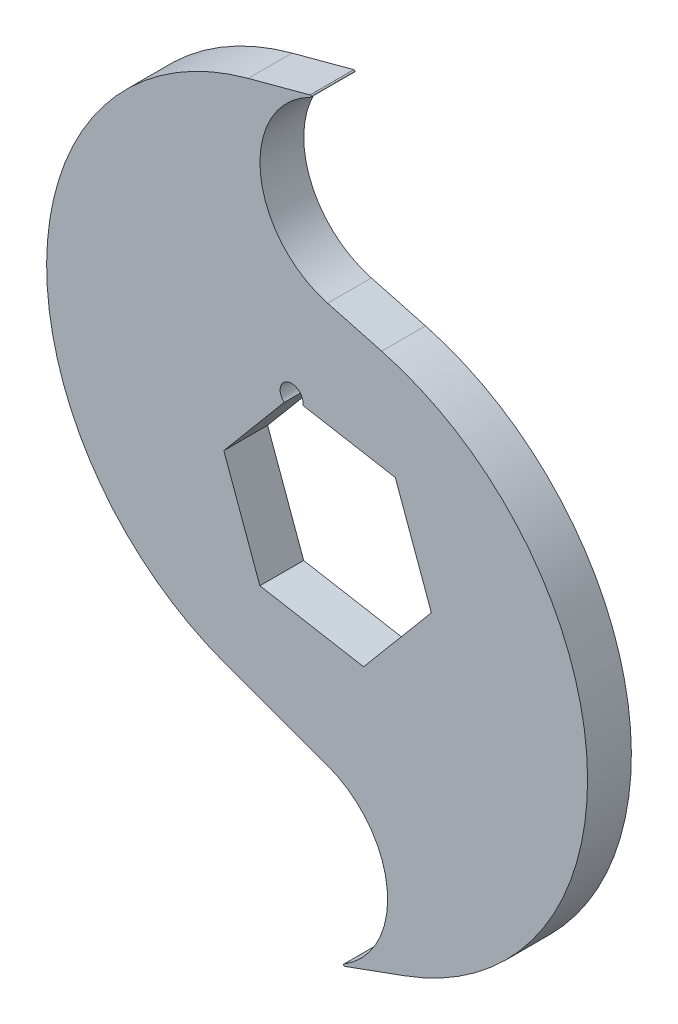
ISO-10303-21;
HEADER;
FILE_DESCRIPTION(('STEP AP214'),'2;1');
FILE_NAME('part.step','',(''),(''),'','','');
FILE_SCHEMA(('AUTOMOTIVE_DESIGN { 1 0 10303 214 1 1 1 1 }'));
ENDSEC;
DATA;
#1=APPLICATION_CONTEXT('core data for automotive mechanical design processes');
#2=APPLICATION_PROTOCOL_DEFINITION('international standard','automotive_design',2000,#1);
#3=PRODUCT_CONTEXT('',#1,'mechanical');
#4=PRODUCT('Part','Part','',(#3));
#5=PRODUCT_RELATED_PRODUCT_CATEGORY('part','',(#4));
#6=PRODUCT_DEFINITION_FORMATION('','',#4);
#7=PRODUCT_DEFINITION_CONTEXT('part definition',#1,'design');
#8=PRODUCT_DEFINITION('design','',#6,#7);
#9=PRODUCT_DEFINITION_SHAPE('','',#8);
#10=(LENGTH_UNIT() NAMED_UNIT(*) SI_UNIT(.MILLI.,.METRE.));
#11=(NAMED_UNIT(*) PLANE_ANGLE_UNIT() SI_UNIT($,.RADIAN.));
#12=(NAMED_UNIT(*) SI_UNIT($,.STERADIAN.) SOLID_ANGLE_UNIT());
#13=UNCERTAINTY_MEASURE_WITH_UNIT(LENGTH_MEASURE(1.E-05),#10,'distance_accuracy_value','');
#14=(GEOMETRIC_REPRESENTATION_CONTEXT(3) GLOBAL_UNCERTAINTY_ASSIGNED_CONTEXT((#13)) GLOBAL_UNIT_ASSIGNED_CONTEXT((#10,
#11,#12)) REPRESENTATION_CONTEXT('',''));
#15=CARTESIAN_POINT('',(0.,0.,0.));
#16=DIRECTION('',(0.,0.,1.));
#17=DIRECTION('',(1.,0.,0.));
#18=AXIS2_PLACEMENT_3D('',#15,#16,#17);
#19=CARTESIAN_POINT('',(-13.0174999999999,48.5819713875279,3.048));
#20=DIRECTION('',(0.258819045102518,-0.965925826289069,0.));
#21=DIRECTION('',(0.965925826289069,0.258819045102518,0.));
#22=AXIS2_PLACEMENT_3D('',#19,#20,#21);
#23=PLANE('',#22);
#24=DIRECTION('',(-0.965925826289069,-0.258819045102518,0.));
#25=VECTOR('',#24,1.);
#26=CARTESIAN_POINT('',(-13.0174999999999,48.5819713875279,3.048));
#27=LINE('',#26,#25);
#28=CARTESIAN_POINT('',(-2.45345159877423,51.4125996254396,3.048));
#29=VERTEX_POINT('',#28);
#30=CARTESIAN_POINT('',(-11.0405321944841,49.1116983144782,3.048));
#31=VERTEX_POINT('',#30);
#32=EDGE_CURVE('E192',#29,#31,#27,.T.);
#33=ORIENTED_EDGE('',*,*,#32,.F.);
#34=DIRECTION('',(0.,0.,1.));
#35=VECTOR('',#34,1.);
#36=CARTESIAN_POINT('',(-2.45345159877423,51.4125996254396,-3.048));
#37=LINE('',#36,#35);
#38=CARTESIAN_POINT('',(-2.45345159877423,51.4125996254396,-3.048));
#39=VERTEX_POINT('',#38);
#40=EDGE_CURVE('E42',#29,#39,#37,.F.);
#41=ORIENTED_EDGE('',*,*,#40,.T.);
#42=DIRECTION('',(-0.965925826289069,-0.258819045102518,0.));
#43=VECTOR('',#42,1.);
#44=CARTESIAN_POINT('',(-13.0174999999999,48.5819713875279,-3.048));
#45=LINE('',#44,#43);
#46=CARTESIAN_POINT('',(-11.0405321944841,49.1116983144782,-3.048));
#47=VERTEX_POINT('',#46);
#48=EDGE_CURVE('E229',#39,#47,#45,.T.);
#49=ORIENTED_EDGE('',*,*,#48,.T.);
#50=DIRECTION('',(0.,0.,-1.));
#51=VECTOR('',#50,1.);
#52=CARTESIAN_POINT('',(-11.0405321944841,49.1116983144782,3.048));
#53=LINE('',#52,#51);
#54=EDGE_CURVE('E260',#31,#47,#53,.T.);
#55=ORIENTED_EDGE('',*,*,#54,.F.);
#56=EDGE_LOOP('',(#33,#41,#49,#55));
#57=FACE_BOUND('',#56,.T.);
#58=ADVANCED_FACE('F34',(#57),#23,.F.);
#59=CARTESIAN_POINT('',(-1.24139416120389,12.5408173038956,3.048));
#60=DIRECTION('',(0.,0.,-1.));
#61=DIRECTION('',(-1.,0.,0.));
#62=AXIS2_PLACEMENT_3D('',#59,#60,#61);
#63=CYLINDRICAL_SURFACE('',#62,37.8609620068675);
#64=CARTESIAN_POINT('',(-1.24139416120389,12.5408173038956,-3.048));
#65=DIRECTION('',(0.,0.,1.));
#66=DIRECTION('',(1.,0.,0.));
#67=AXIS2_PLACEMENT_3D('',#64,#65,#66);
#68=CIRCLE('',#67,37.8609620068675);
#69=CARTESIAN_POINT('',(-14.1906058132406,-23.0368493098134,-3.048));
#70=VERTEX_POINT('',#69);
#71=EDGE_CURVE('E231',#47,#70,#68,.T.);
#72=ORIENTED_EDGE('',*,*,#71,.T.);
#73=DIRECTION('',(0.,0.,-1.));
#74=VECTOR('',#73,1.);
#75=CARTESIAN_POINT('',(-14.1906058132406,-23.0368493098134,3.048));
#76=LINE('',#75,#74);
#77=CARTESIAN_POINT('',(-14.1906058132406,-23.0368493098134,3.048));
#78=VERTEX_POINT('',#77);
#79=EDGE_CURVE('E258',#78,#70,#76,.T.);
#80=ORIENTED_EDGE('',*,*,#79,.F.);
#81=CARTESIAN_POINT('',(-1.24139416120389,12.5408173038956,3.048));
#82=DIRECTION('',(0.,0.,1.));
#83=DIRECTION('',(1.,0.,0.));
#84=AXIS2_PLACEMENT_3D('',#81,#82,#83);
#85=CIRCLE('',#84,37.8609620068675);
#86=EDGE_CURVE('E194',#31,#78,#85,.T.);
#87=ORIENTED_EDGE('',*,*,#86,.F.);
#88=ORIENTED_EDGE('',*,*,#54,.T.);
#89=EDGE_LOOP('',(#72,#80,#87,#88));
#90=FACE_BOUND('',#89,.T.);
#91=ADVANCED_FACE('F298',(#90),#63,.T.);
#92=CARTESIAN_POINT('',(-9.06388619403997,-24.902822650631,3.048));
#93=DIRECTION('',(-0.342020143325673,-0.939692620785907,0.));
#94=DIRECTION('',(0.939692620785907,-0.342020143325673,0.));
#95=AXIS2_PLACEMENT_3D('',#92,#93,#94);
#96=PLANE('',#95);
#97=DIRECTION('',(-0.939692620785907,0.342020143325673,0.));
#98=VECTOR('',#97,1.);
#99=CARTESIAN_POINT('',(-9.06388619403997,-24.902822650631,-3.048));
#100=LINE('',#99,#98);
#101=CARTESIAN_POINT('',(0.,-28.2018074320379,-3.048));
#102=VERTEX_POINT('',#101);
#103=EDGE_CURVE('E234',#102,#70,#100,.T.);
#104=ORIENTED_EDGE('',*,*,#103,.F.);
#105=DIRECTION('',(0.,0.,-1.));
#106=VECTOR('',#105,1.);
#107=CARTESIAN_POINT('',(0.,-28.2018074320379,3.048));
#108=LINE('',#107,#106);
#109=CARTESIAN_POINT('',(0.,-28.2018074320379,3.048));
#110=VERTEX_POINT('',#109);
#111=EDGE_CURVE('E255',#110,#102,#108,.T.);
#112=ORIENTED_EDGE('',*,*,#111,.F.);
#113=DIRECTION('',(-0.939692620785907,0.342020143325673,0.));
#114=VECTOR('',#113,1.);
#115=CARTESIAN_POINT('',(-9.06388619403997,-24.902822650631,3.048));
#116=LINE('',#115,#114);
#117=EDGE_CURVE('E196',#110,#78,#116,.T.);
#118=ORIENTED_EDGE('',*,*,#117,.T.);
#119=ORIENTED_EDGE('',*,*,#79,.T.);
#120=EDGE_LOOP('',(#104,#112,#118,#119));
#121=FACE_BOUND('',#120,.T.);
#122=ADVANCED_FACE('F304',(#121),#96,.T.);
#123=CARTESIAN_POINT('',(-4.34365582023604,-40.135903716019,3.048));
#124=DIRECTION('',(0.,0.,-1.));
#125=DIRECTION('',(-1.,0.,0.));
#126=AXIS2_PLACEMENT_3D('',#123,#124,#125);
#127=CYLINDRICAL_SURFACE('',#126,12.7);
#128=CARTESIAN_POINT('',(-4.34365582023604,-40.135903716019,-3.048));
#129=DIRECTION('',(0.,0.,1.));
#130=DIRECTION('',(1.,0.,0.));
#131=AXIS2_PLACEMENT_3D('',#128,#129,#130);
#132=CIRCLE('',#131,12.7);
#133=CARTESIAN_POINT('',(2.27717439642722,-50.9735513963101,-3.048));
#134=VERTEX_POINT('',#133);
#135=EDGE_CURVE('E237',#134,#102,#132,.T.);
#136=ORIENTED_EDGE('',*,*,#135,.F.);
#137=DIRECTION('',(0.,0.,-1.));
#138=VECTOR('',#137,1.);
#139=CARTESIAN_POINT('',(2.27717439642722,-50.9735513963101,3.048));
#140=LINE('',#139,#138);
#141=CARTESIAN_POINT('',(2.27717439642722,-50.9735513963101,3.048));
#142=VERTEX_POINT('',#141);
#143=EDGE_CURVE('E280',#134,#142,#140,.F.);
#144=ORIENTED_EDGE('',*,*,#143,.T.);
#145=CARTESIAN_POINT('',(-4.34365582023604,-40.135903716019,3.048));
#146=DIRECTION('',(0.,0.,1.));
#147=DIRECTION('',(1.,0.,0.));
#148=AXIS2_PLACEMENT_3D('',#145,#146,#147);
#149=CIRCLE('',#148,12.7);
#150=EDGE_CURVE('E199',#142,#110,#149,.T.);
#151=ORIENTED_EDGE('',*,*,#150,.T.);
#152=ORIENTED_EDGE('',*,*,#111,.T.);
#153=EDGE_LOOP('',(#136,#144,#151,#152));
#154=FACE_BOUND('',#153,.T.);
#155=ADVANCED_FACE('F307',(#154),#127,.F.);
#156=CARTESIAN_POINT('',(16.7349754181892,-45.9789670766024,3.048));
#157=DIRECTION('',(-0.342020143325673,0.939692620785907,0.));
#158=DIRECTION('',(-0.939692620785907,-0.342020143325673,0.));
#159=AXIS2_PLACEMENT_3D('',#156,#157,#158);
#160=PLANE('',#159);
#161=DIRECTION('',(0.939692620785907,0.342020143325673,0.));
#162=VECTOR('',#161,1.);
#163=CARTESIAN_POINT('',(16.7349754181892,-45.9789670766024,3.048));
#164=LINE('',#163,#162);
#165=CARTESIAN_POINT('',(2.38681925679621,-51.2012688359528,3.048));
#166=VERTEX_POINT('',#165);
#167=CARTESIAN_POINT('',(10.7406866555829,-48.1607097617875,3.048));
#168=VERTEX_POINT('',#167);
#169=EDGE_CURVE('E201',#166,#168,#164,.T.);
#170=ORIENTED_EDGE('',*,*,#169,.F.);
#171=DIRECTION('',(0.,0.,1.));
#172=VECTOR('',#171,1.);
#173=CARTESIAN_POINT('',(2.38681925679621,-51.2012688359528,-3.048));
#174=LINE('',#173,#172);
#175=CARTESIAN_POINT('',(2.38681925679621,-51.2012688359528,-3.048));
#176=VERTEX_POINT('',#175);
#177=EDGE_CURVE('E263',#166,#176,#174,.F.);
#178=ORIENTED_EDGE('',*,*,#177,.T.);
#179=DIRECTION('',(0.939692620785907,0.342020143325673,0.));
#180=VECTOR('',#179,1.);
#181=CARTESIAN_POINT('',(16.7349754181892,-45.9789670766024,-3.048));
#182=LINE('',#181,#180);
#183=CARTESIAN_POINT('',(10.7406866555829,-48.1607097617875,-3.048));
#184=VERTEX_POINT('',#183);
#185=EDGE_CURVE('E239',#176,#184,#182,.T.);
#186=ORIENTED_EDGE('',*,*,#185,.T.);
#187=DIRECTION('',(0.,0.,-1.));
#188=VECTOR('',#187,1.);
#189=CARTESIAN_POINT('',(10.7406866555829,-48.1607097617875,3.048));
#190=LINE('',#189,#188);
#191=EDGE_CURVE('E252',#168,#184,#190,.T.);
#192=ORIENTED_EDGE('',*,*,#191,.F.);
#193=EDGE_LOOP('',(#170,#178,#186,#192));
#194=FACE_BOUND('',#193,.T.);
#195=ADVANCED_FACE('F315',(#194),#160,.F.);
#196=CARTESIAN_POINT('',(-2.48342826754325,-11.827752618226,3.048));
#197=DIRECTION('',(0.,0.,-1.));
#198=DIRECTION('',(-1.,0.,0.));
#199=AXIS2_PLACEMENT_3D('',#196,#197,#198);
#200=CYLINDRICAL_SURFACE('',#199,38.6647254004982);
#201=CARTESIAN_POINT('',(-2.48342826754325,-11.827752618226,-3.048));
#202=DIRECTION('',(0.,0.,1.));
#203=DIRECTION('',(1.,0.,0.));
#204=AXIS2_PLACEMENT_3D('',#201,#202,#203);
#205=CIRCLE('',#204,38.6647254004982);
#206=CARTESIAN_POINT('',(7.52373903976479,25.5195042124902,-3.048));
#207=VERTEX_POINT('',#206);
#208=EDGE_CURVE('E241',#184,#207,#205,.T.);
#209=ORIENTED_EDGE('',*,*,#208,.T.);
#210=DIRECTION('',(0.,0.,-1.));
#211=VECTOR('',#210,1.);
#212=CARTESIAN_POINT('',(7.52373903976479,25.5195042124902,3.048));
#213=LINE('',#212,#211);
#214=CARTESIAN_POINT('',(7.52373903976479,25.5195042124902,3.048));
#215=VERTEX_POINT('',#214);
#216=EDGE_CURVE('E250',#215,#207,#213,.T.);
#217=ORIENTED_EDGE('',*,*,#216,.F.);
#218=CARTESIAN_POINT('',(-2.48342826754325,-11.827752618226,3.048));
#219=DIRECTION('',(0.,0.,1.));
#220=DIRECTION('',(1.,0.,0.));
#221=AXIS2_PLACEMENT_3D('',#218,#219,#220);
#222=CIRCLE('',#221,38.6647254004982);
#223=EDGE_CURVE('E203',#168,#215,#222,.T.);
#224=ORIENTED_EDGE('',*,*,#223,.F.);
#225=ORIENTED_EDGE('',*,*,#191,.T.);
#226=EDGE_LOOP('',(#209,#217,#224,#225));
#227=FACE_BOUND('',#226,.T.);
#228=ADVANCED_FACE('F320',(#227),#200,.T.);
#229=CARTESIAN_POINT('',(6.88387100306434,25.6909563361866,3.048));
#230=DIRECTION('',(0.258819045102518,0.965925826289069,0.));
#231=DIRECTION('',(-0.965925826289069,0.258819045102518,0.));
#232=AXIS2_PLACEMENT_3D('',#229,#230,#231);
#233=PLANE('',#232);
#234=DIRECTION('',(0.965925826289069,-0.258819045102518,0.));
#235=VECTOR('',#234,1.);
#236=CARTESIAN_POINT('',(6.88387100306434,25.6909563361866,-3.048));
#237=LINE('',#236,#235);
#238=CARTESIAN_POINT('',(0.,27.5354840122576,-3.048));
#239=VERTEX_POINT('',#238);
#240=EDGE_CURVE('E244',#239,#207,#237,.T.);
#241=ORIENTED_EDGE('',*,*,#240,.F.);
#242=DIRECTION('',(0.,0.,-1.));
#243=VECTOR('',#242,1.);
#244=CARTESIAN_POINT('',(0.,27.5354840122576,3.048));
#245=LINE('',#244,#243);
#246=CARTESIAN_POINT('',(0.,27.5354840122576,3.048));
#247=VERTEX_POINT('',#246);
#248=EDGE_CURVE('E163',#247,#239,#245,.T.);
#249=ORIENTED_EDGE('',*,*,#248,.F.);
#250=DIRECTION('',(0.965925826289069,-0.258819045102518,0.));
#251=VECTOR('',#250,1.);
#252=CARTESIAN_POINT('',(6.88387100306434,25.6909563361866,3.048));
#253=LINE('',#252,#251);
#254=EDGE_CURVE('E205',#247,#215,#253,.T.);
#255=ORIENTED_EDGE('',*,*,#254,.T.);
#256=ORIENTED_EDGE('',*,*,#216,.T.);
#257=EDGE_LOOP('',(#241,#249,#255,#256));
#258=FACE_BOUND('',#257,.T.);
#259=ADVANCED_FACE('F325',(#258),#233,.T.);
#260=CARTESIAN_POINT('',(-5.01562171416058,13.7803074041828,3.048));
#261=DIRECTION('',(0.,0.,-1.));
#262=DIRECTION('',(-1.,0.,0.));
#263=AXIS2_PLACEMENT_3D('',#260,#261,#262);
#264=CYLINDRICAL_SURFACE('',#263,1.5875);
#265=CARTESIAN_POINT('',(-5.01562171416058,13.7803074041828,-3.048));
#266=DIRECTION('',(0.,0.,1.));
#267=DIRECTION('',(1.,0.,0.));
#268=AXIS2_PLACEMENT_3D('',#265,#266,#267);
#269=CIRCLE('',#268,1.5875);
#270=CARTESIAN_POINT('',(-3.45223940625371,13.5046409221365,-3.048));
#271=VERTEX_POINT('',#270);
#272=CARTESIAN_POINT('',(-6.03604704453797,12.5642118507314,-3.048));
#273=VERTEX_POINT('',#272);
#274=EDGE_CURVE('E158',#271,#273,#269,.T.);
#275=ORIENTED_EDGE('',*,*,#274,.F.);
#276=DIRECTION('',(0.,0.,-1.));
#277=VECTOR('',#276,1.);
#278=CARTESIAN_POINT('',(-3.45223940625371,13.5046409221365,3.048));
#279=LINE('',#278,#277);
#280=CARTESIAN_POINT('',(-3.45223940625371,13.5046409221365,3.048));
#281=VERTEX_POINT('',#280);
#282=EDGE_CURVE('E152',#281,#271,#279,.T.);
#283=ORIENTED_EDGE('',*,*,#282,.F.);
#284=CARTESIAN_POINT('',(-5.01562171416058,13.7803074041828,3.048));
#285=DIRECTION('',(0.,0.,1.));
#286=DIRECTION('',(1.,0.,0.));
#287=AXIS2_PLACEMENT_3D('',#284,#285,#286);
#288=CIRCLE('',#287,1.5875);
#289=CARTESIAN_POINT('',(-6.03604704453797,12.5642118507314,3.048));
#290=VERTEX_POINT('',#289);
#291=EDGE_CURVE('E155',#281,#290,#288,.T.);
#292=ORIENTED_EDGE('',*,*,#291,.T.);
#293=DIRECTION('',(0.,0.,-1.));
#294=VECTOR('',#293,1.);
#295=CARTESIAN_POINT('',(-6.03604704453797,12.5642118507314,3.048));
#296=LINE('',#295,#294);
#297=EDGE_CURVE('E210',#290,#273,#296,.T.);
#298=ORIENTED_EDGE('',*,*,#297,.T.);
#299=EDGE_LOOP('',(#275,#283,#292,#298));
#300=FACE_BOUND('',#299,.T.);
#301=ADVANCED_FACE('F154',(#300),#264,.F.);
#302=CARTESIAN_POINT('',(2.2053318563701,12.507058463255,3.048));
#303=DIRECTION('',(-0.173648177666937,-0.984807753012207,0.));
#304=DIRECTION('',(0.984807753012207,-0.173648177666937,0.));
#305=AXIS2_PLACEMENT_3D('',#302,#303,#304);
#306=PLANE('',#305);
#307=DIRECTION('',(-0.984807753012207,0.173648177666937,0.));
#308=VECTOR('',#307,1.);
#309=CARTESIAN_POINT('',(2.2053318563701,12.507058463255,-3.048));
#310=LINE('',#309,#308);
#311=CARTESIAN_POINT('',(9.42628542690078,11.2338095223273,-3.048));
#312=VERTEX_POINT('',#311);
#313=EDGE_CURVE('E212',#312,#271,#310,.T.);
#314=ORIENTED_EDGE('',*,*,#313,.F.);
#315=DIRECTION('',(0.,0.,-1.));
#316=VECTOR('',#315,1.);
#317=CARTESIAN_POINT('',(9.42628542690078,11.2338095223273,3.048));
#318=LINE('',#317,#316);
#319=CARTESIAN_POINT('',(9.42628542690078,11.2338095223273,3.048));
#320=VERTEX_POINT('',#319);
#321=EDGE_CURVE('E164',#320,#312,#318,.T.);
#322=ORIENTED_EDGE('',*,*,#321,.F.);
#323=DIRECTION('',(-0.984807753012207,0.173648177666937,0.));
#324=VECTOR('',#323,1.);
#325=CARTESIAN_POINT('',(2.2053318563701,12.507058463255,3.048));
#326=LINE('',#325,#324);
#327=EDGE_CURVE('E170',#320,#281,#326,.T.);
#328=ORIENTED_EDGE('',*,*,#327,.T.);
#329=ORIENTED_EDGE('',*,*,#282,.T.);
#330=EDGE_LOOP('',(#314,#322,#328,#329));
#331=FACE_BOUND('',#330,.T.);
#332=ADVANCED_FACE('F177',(#331),#306,.T.);
#333=CARTESIAN_POINT('',(11.9340962839811,4.34365582023592,3.048));
#334=DIRECTION('',(-0.939692620785911,-0.342020143325663,0.));
#335=DIRECTION('',(0.342020143325663,-0.939692620785911,0.));
#336=AXIS2_PLACEMENT_3D('',#333,#334,#335);
#337=PLANE('',#336);
#338=DIRECTION('',(-0.342020143325663,0.939692620785911,0.));
#339=VECTOR('',#338,1.);
#340=CARTESIAN_POINT('',(11.9340962839811,4.34365582023592,-3.048));
#341=LINE('',#340,#339);
#342=CARTESIAN_POINT('',(14.4419071410614,-2.54649788185546,-3.048));
#343=VERTEX_POINT('',#342);
#344=EDGE_CURVE('E214',#343,#312,#341,.T.);
#345=ORIENTED_EDGE('',*,*,#344,.F.);
#346=DIRECTION('',(0.,0.,-1.));
#347=VECTOR('',#346,1.);
#348=CARTESIAN_POINT('',(14.4419071410614,-2.54649788185546,3.048));
#349=LINE('',#348,#347);
#350=CARTESIAN_POINT('',(14.4419071410614,-2.54649788185546,3.048));
#351=VERTEX_POINT('',#350);
#352=EDGE_CURVE('E271',#351,#343,#349,.T.);
#353=ORIENTED_EDGE('',*,*,#352,.F.);
#354=DIRECTION('',(-0.342020143325663,0.939692620785911,0.));
#355=VECTOR('',#354,1.);
#356=CARTESIAN_POINT('',(11.9340962839811,4.34365582023592,3.048));
#357=LINE('',#356,#355);
#358=EDGE_CURVE('E178',#351,#320,#357,.T.);
#359=ORIENTED_EDGE('',*,*,#358,.T.);
#360=ORIENTED_EDGE('',*,*,#321,.T.);
#361=EDGE_LOOP('',(#345,#353,#359,#360));
#362=FACE_BOUND('',#361,.T.);
#363=ADVANCED_FACE('F354',(#362),#337,.T.);
#364=CARTESIAN_POINT('',(9.72876442761098,-8.16340264301911,3.048));
#365=DIRECTION('',(-0.766044443118974,0.642787609686544,0.));
#366=DIRECTION('',(-0.642787609686544,-0.766044443118974,0.));
#367=AXIS2_PLACEMENT_3D('',#364,#365,#366);
#368=PLANE('',#367);
#369=DIRECTION('',(0.642787609686544,0.766044443118974,0.));
#370=VECTOR('',#369,1.);
#371=CARTESIAN_POINT('',(9.72876442761098,-8.16340264301911,-3.048));
#372=LINE('',#371,#370);
#373=CARTESIAN_POINT('',(5.01562171416058,-13.7803074041828,-3.048));
#374=VERTEX_POINT('',#373);
#375=EDGE_CURVE('E217',#374,#343,#372,.T.);
#376=ORIENTED_EDGE('',*,*,#375,.F.);
#377=DIRECTION('',(0.,0.,-1.));
#378=VECTOR('',#377,1.);
#379=CARTESIAN_POINT('',(5.01562171416058,-13.7803074041828,3.048));
#380=LINE('',#379,#378);
#381=CARTESIAN_POINT('',(5.01562171416058,-13.7803074041828,3.048));
#382=VERTEX_POINT('',#381);
#383=EDGE_CURVE('E269',#382,#374,#380,.T.);
#384=ORIENTED_EDGE('',*,*,#383,.F.);
#385=DIRECTION('',(0.642787609686544,0.766044443118974,0.));
#386=VECTOR('',#385,1.);
#387=CARTESIAN_POINT('',(9.72876442761098,-8.16340264301911,3.048));
#388=LINE('',#387,#386);
#389=EDGE_CURVE('E180',#382,#351,#388,.T.);
#390=ORIENTED_EDGE('',*,*,#389,.T.);
#391=ORIENTED_EDGE('',*,*,#352,.T.);
#392=EDGE_LOOP('',(#376,#384,#390,#391));
#393=FACE_BOUND('',#392,.T.);
#394=ADVANCED_FACE('F350',(#393),#368,.T.);
#395=CARTESIAN_POINT('',(-2.2053318563701,-12.507058463255,3.048));
#396=DIRECTION('',(0.173648177666937,0.984807753012207,0.));
#397=DIRECTION('',(-0.984807753012207,0.173648177666937,0.));
#398=AXIS2_PLACEMENT_3D('',#395,#396,#397);
#399=PLANE('',#398);
#400=DIRECTION('',(0.984807753012207,-0.173648177666937,0.));
#401=VECTOR('',#400,1.);
#402=CARTESIAN_POINT('',(-2.2053318563701,-12.507058463255,-3.048));
#403=LINE('',#402,#401);
#404=CARTESIAN_POINT('',(-9.42628542690078,-11.2338095223273,-3.048));
#405=VERTEX_POINT('',#404);
#406=EDGE_CURVE('E220',#405,#374,#403,.T.);
#407=ORIENTED_EDGE('',*,*,#406,.F.);
#408=DIRECTION('',(0.,0.,-1.));
#409=VECTOR('',#408,1.);
#410=CARTESIAN_POINT('',(-9.42628542690078,-11.2338095223273,3.048));
#411=LINE('',#410,#409);
#412=CARTESIAN_POINT('',(-9.42628542690078,-11.2338095223273,3.048));
#413=VERTEX_POINT('',#412);
#414=EDGE_CURVE('E267',#413,#405,#411,.T.);
#415=ORIENTED_EDGE('',*,*,#414,.F.);
#416=DIRECTION('',(0.984807753012207,-0.173648177666937,0.));
#417=VECTOR('',#416,1.);
#418=CARTESIAN_POINT('',(-2.2053318563701,-12.507058463255,3.048));
#419=LINE('',#418,#417);
#420=EDGE_CURVE('E185',#413,#382,#419,.T.);
#421=ORIENTED_EDGE('',*,*,#420,.T.);
#422=ORIENTED_EDGE('',*,*,#383,.T.);
#423=EDGE_LOOP('',(#407,#415,#421,#422));
#424=FACE_BOUND('',#423,.T.);
#425=ADVANCED_FACE('F346',(#424),#399,.T.);
#426=CARTESIAN_POINT('',(-11.9340962839811,-4.34365582023592,3.048));
#427=DIRECTION('',(0.939692620785911,0.342020143325662,0.));
#428=DIRECTION('',(-0.342020143325662,0.939692620785911,0.));
#429=AXIS2_PLACEMENT_3D('',#426,#427,#428);
#430=PLANE('',#429);
#431=DIRECTION('',(0.342020143325662,-0.939692620785911,0.));
#432=VECTOR('',#431,1.);
#433=CARTESIAN_POINT('',(-11.9340962839811,-4.34365582023592,-3.048));
#434=LINE('',#433,#432);
#435=CARTESIAN_POINT('',(-14.4419071410614,2.54649788185546,-3.048));
#436=VERTEX_POINT('',#435);
#437=EDGE_CURVE('E223',#436,#405,#434,.T.);
#438=ORIENTED_EDGE('',*,*,#437,.F.);
#439=DIRECTION('',(0.,0.,-1.));
#440=VECTOR('',#439,1.);
#441=CARTESIAN_POINT('',(-14.4419071410614,2.54649788185546,3.048));
#442=LINE('',#441,#440);
#443=CARTESIAN_POINT('',(-14.4419071410614,2.54649788185546,3.048));
#444=VERTEX_POINT('',#443);
#445=EDGE_CURVE('E265',#444,#436,#442,.T.);
#446=ORIENTED_EDGE('',*,*,#445,.F.);
#447=DIRECTION('',(0.342020143325662,-0.939692620785911,0.));
#448=VECTOR('',#447,1.);
#449=CARTESIAN_POINT('',(-11.9340962839811,-4.34365582023592,3.048));
#450=LINE('',#449,#448);
#451=EDGE_CURVE('E188',#444,#413,#450,.T.);
#452=ORIENTED_EDGE('',*,*,#451,.T.);
#453=ORIENTED_EDGE('',*,*,#414,.T.);
#454=EDGE_LOOP('',(#438,#446,#452,#453));
#455=FACE_BOUND('',#454,.T.);
#456=ADVANCED_FACE('F342',(#455),#430,.T.);
#457=CARTESIAN_POINT('',(-9.72876442761098,8.16340264301911,3.048));
#458=DIRECTION('',(0.766044443118974,-0.642787609686544,0.));
#459=DIRECTION('',(0.642787609686544,0.766044443118974,0.));
#460=AXIS2_PLACEMENT_3D('',#457,#458,#459);
#461=PLANE('',#460);
#462=DIRECTION('',(-0.642787609686544,-0.766044443118974,0.));
#463=VECTOR('',#462,1.);
#464=CARTESIAN_POINT('',(-9.72876442761098,8.16340264301911,-3.048));
#465=LINE('',#464,#463);
#466=EDGE_CURVE('E226',#273,#436,#465,.T.);
#467=ORIENTED_EDGE('',*,*,#466,.F.);
#468=ORIENTED_EDGE('',*,*,#297,.F.);
#469=DIRECTION('',(-0.642787609686544,-0.766044443118974,0.));
#470=VECTOR('',#469,1.);
#471=CARTESIAN_POINT('',(-9.72876442761098,8.16340264301911,3.048));
#472=LINE('',#471,#470);
#473=EDGE_CURVE('E174',#290,#444,#472,.T.);
#474=ORIENTED_EDGE('',*,*,#473,.T.);
#475=ORIENTED_EDGE('',*,*,#445,.T.);
#476=EDGE_LOOP('',(#467,#468,#474,#475));
#477=FACE_BOUND('',#476,.T.);
#478=ADVANCED_FACE('F339',(#477),#461,.T.);
#479=CARTESIAN_POINT('',(3.28700187280198,39.8027420061288,3.048));
#480=DIRECTION('',(0.,0.,-1.));
#481=DIRECTION('',(-1.,0.,0.));
#482=AXIS2_PLACEMENT_3D('',#479,#480,#481);
#483=CYLINDRICAL_SURFACE('',#482,12.7);
#484=CARTESIAN_POINT('',(3.28700187280198,39.8027420061288,-3.048));
#485=DIRECTION('',(0.,0.,1.));
#486=DIRECTION('',(1.,0.,0.));
#487=AXIS2_PLACEMENT_3D('',#484,#485,#486);
#488=CIRCLE('',#487,12.7);
#489=CARTESIAN_POINT('',(-2.36407085279029,51.1761925401606,-3.048));
#490=VERTEX_POINT('',#489);
#491=EDGE_CURVE('E175',#490,#239,#488,.T.);
#492=ORIENTED_EDGE('',*,*,#491,.F.);
#493=DIRECTION('',(0.,0.,-1.));
#494=VECTOR('',#493,1.);
#495=CARTESIAN_POINT('',(-2.36407085279029,51.1761925401606,3.048));
#496=LINE('',#495,#494);
#497=CARTESIAN_POINT('',(-2.36407085279029,51.1761925401606,3.048));
#498=VERTEX_POINT('',#497);
#499=EDGE_CURVE('E11',#490,#498,#496,.F.);
#500=ORIENTED_EDGE('',*,*,#499,.T.);
#501=CARTESIAN_POINT('',(3.28700187280198,39.8027420061288,3.048));
#502=DIRECTION('',(0.,0.,1.));
#503=DIRECTION('',(1.,0.,0.));
#504=AXIS2_PLACEMENT_3D('',#501,#502,#503);
#505=CIRCLE('',#504,12.7);
#506=EDGE_CURVE('E208',#498,#247,#505,.T.);
#507=ORIENTED_EDGE('',*,*,#506,.T.);
#508=ORIENTED_EDGE('',*,*,#248,.T.);
#509=EDGE_LOOP('',(#492,#500,#507,#508));
#510=FACE_BOUND('',#509,.T.);
#511=ADVANCED_FACE('F326',(#510),#483,.F.);
#512=CARTESIAN_POINT('',(0.,0.,3.048));
#513=DIRECTION('',(0.,0.,1.));
#514=DIRECTION('',(1.,0.,0.));
#515=AXIS2_PLACEMENT_3D('',#512,#513,#514);
#516=PLANE('',#515);
#517=ORIENTED_EDGE('',*,*,#291,.F.);
#518=ORIENTED_EDGE('',*,*,#327,.F.);
#519=ORIENTED_EDGE('',*,*,#358,.F.);
#520=ORIENTED_EDGE('',*,*,#389,.F.);
#521=ORIENTED_EDGE('',*,*,#420,.F.);
#522=ORIENTED_EDGE('',*,*,#451,.F.);
#523=ORIENTED_EDGE('',*,*,#473,.F.);
#524=EDGE_LOOP('',(#517,#518,#519,#520,#521,#522,#523));
#525=FACE_BOUND('',#524,.T.);
#526=ORIENTED_EDGE('',*,*,#150,.F.);
#527=CARTESIAN_POINT('',(2.34338269859385,-51.081927873113,3.048));
#528=DIRECTION('',(0.,0.,1.));
#529=DIRECTION('',(1.,0.,0.));
#530=AXIS2_PLACEMENT_3D('',#527,#528,#529);
#531=CIRCLE('',#530,0.127);
#532=EDGE_CURVE('E283',#142,#166,#531,.T.);
#533=ORIENTED_EDGE('',*,*,#532,.T.);
#534=ORIENTED_EDGE('',*,*,#169,.T.);
#535=ORIENTED_EDGE('',*,*,#223,.T.);
#536=ORIENTED_EDGE('',*,*,#254,.F.);
#537=ORIENTED_EDGE('',*,*,#506,.F.);
#538=CARTESIAN_POINT('',(-2.42058158004621,51.2899270455009,3.048));
#539=DIRECTION('',(0.,0.,1.));
#540=DIRECTION('',(1.,0.,0.));
#541=AXIS2_PLACEMENT_3D('',#538,#539,#540);
#542=CIRCLE('',#541,0.127);
#543=EDGE_CURVE('E54',#498,#29,#542,.T.);
#544=ORIENTED_EDGE('',*,*,#543,.T.);
#545=ORIENTED_EDGE('',*,*,#32,.T.);
#546=ORIENTED_EDGE('',*,*,#86,.T.);
#547=ORIENTED_EDGE('',*,*,#117,.F.);
#548=EDGE_LOOP('',(#526,#533,#534,#535,#536,#537,#544,#545,#546,#547));
#549=FACE_BOUND('',#548,.T.);
#550=ADVANCED_FACE('F168',(#525,#549),#516,.T.);
#551=CARTESIAN_POINT('',(0.,0.,-3.048));
#552=DIRECTION('',(0.,0.,1.));
#553=DIRECTION('',(1.,0.,0.));
#554=AXIS2_PLACEMENT_3D('',#551,#552,#553);
#555=PLANE('',#554);
#556=ORIENTED_EDGE('',*,*,#274,.T.);
#557=ORIENTED_EDGE('',*,*,#466,.T.);
#558=ORIENTED_EDGE('',*,*,#437,.T.);
#559=ORIENTED_EDGE('',*,*,#406,.T.);
#560=ORIENTED_EDGE('',*,*,#375,.T.);
#561=ORIENTED_EDGE('',*,*,#344,.T.);
#562=ORIENTED_EDGE('',*,*,#313,.T.);
#563=EDGE_LOOP('',(#556,#557,#558,#559,#560,#561,#562));
#564=FACE_BOUND('',#563,.T.);
#565=ORIENTED_EDGE('',*,*,#185,.F.);
#566=CARTESIAN_POINT('',(2.34338269859385,-51.081927873113,-3.048));
#567=DIRECTION('',(0.,0.,1.));
#568=DIRECTION('',(1.,0.,0.));
#569=AXIS2_PLACEMENT_3D('',#566,#567,#568);
#570=CIRCLE('',#569,0.127);
#571=EDGE_CURVE('E278',#176,#134,#570,.F.);
#572=ORIENTED_EDGE('',*,*,#571,.T.);
#573=ORIENTED_EDGE('',*,*,#135,.T.);
#574=ORIENTED_EDGE('',*,*,#103,.T.);
#575=ORIENTED_EDGE('',*,*,#71,.F.);
#576=ORIENTED_EDGE('',*,*,#48,.F.);
#577=CARTESIAN_POINT('',(-2.42058158004621,51.2899270455009,-3.048));
#578=DIRECTION('',(0.,0.,1.));
#579=DIRECTION('',(1.,0.,0.));
#580=AXIS2_PLACEMENT_3D('',#577,#578,#579);
#581=CIRCLE('',#580,0.127);
#582=EDGE_CURVE('E276',#39,#490,#581,.F.);
#583=ORIENTED_EDGE('',*,*,#582,.T.);
#584=ORIENTED_EDGE('',*,*,#491,.T.);
#585=ORIENTED_EDGE('',*,*,#240,.T.);
#586=ORIENTED_EDGE('',*,*,#208,.F.);
#587=EDGE_LOOP('',(#565,#572,#573,#574,#575,#576,#583,#584,#585,#586));
#588=FACE_BOUND('',#587,.T.);
#589=ADVANCED_FACE('F293',(#564,#588),#555,.F.);
#590=CARTESIAN_POINT('',(2.34338269859385,-51.081927873113,3.048));
#591=DIRECTION('',(0.,0.,-1.));
#592=DIRECTION('',(-1.,0.,0.));
#593=AXIS2_PLACEMENT_3D('',#590,#591,#592);
#594=CYLINDRICAL_SURFACE('',#593,0.127);
#595=ORIENTED_EDGE('',*,*,#532,.F.);
#596=ORIENTED_EDGE('',*,*,#143,.F.);
#597=ORIENTED_EDGE('',*,*,#571,.F.);
#598=ORIENTED_EDGE('',*,*,#177,.F.);
#599=EDGE_LOOP('',(#595,#596,#597,#598));
#600=FACE_BOUND('',#599,.T.);
#601=ADVANCED_FACE('F310',(#600),#594,.T.);
#602=CARTESIAN_POINT('',(-2.42058158004621,51.2899270455009,3.048));
#603=DIRECTION('',(0.,0.,-1.));
#604=DIRECTION('',(-1.,0.,0.));
#605=AXIS2_PLACEMENT_3D('',#602,#603,#604);
#606=CYLINDRICAL_SURFACE('',#605,0.127);
#607=ORIENTED_EDGE('',*,*,#543,.F.);
#608=ORIENTED_EDGE('',*,*,#499,.F.);
#609=ORIENTED_EDGE('',*,*,#582,.F.);
#610=ORIENTED_EDGE('',*,*,#40,.F.);
#611=EDGE_LOOP('',(#607,#608,#609,#610));
#612=FACE_BOUND('',#611,.T.);
#613=ADVANCED_FACE('F36',(#612),#606,.T.);
#614=CLOSED_SHELL('',(#58,#91,#122,#155,#195,#228,#259,#301,#332,#363,#394,#425,#456,#478,#511,
#550,#589,#601,#613));
#615=MANIFOLD_SOLID_BREP('B2',#614);
#616=ADVANCED_BREP_SHAPE_REPRESENTATION('',(#18,#615),#14);
#617=SHAPE_DEFINITION_REPRESENTATION(#9,#616);
ENDSEC;
END-ISO-10303-21;
